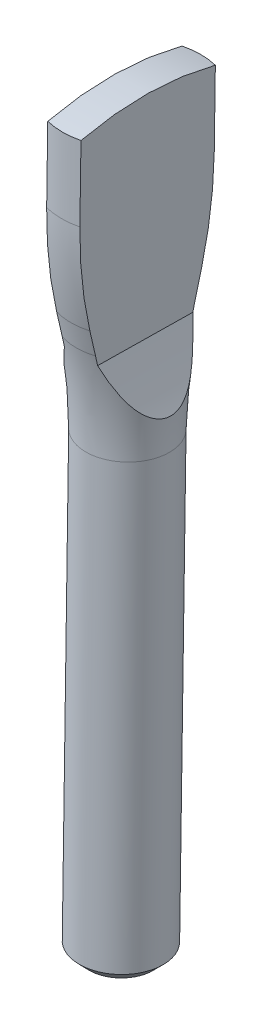
ISO-10303-21;
HEADER;
FILE_DESCRIPTION(('STEP AP214'),'2;1');
FILE_NAME('part.step','',(''),(''),'','','');
FILE_SCHEMA(('AUTOMOTIVE_DESIGN { 1 0 10303 214 1 1 1 1 }'));
ENDSEC;
DATA;
#1=APPLICATION_CONTEXT('core data for automotive mechanical design processes');
#2=APPLICATION_PROTOCOL_DEFINITION('international standard','automotive_design',2000,#1);
#3=PRODUCT_CONTEXT('',#1,'mechanical');
#4=PRODUCT('Part','Part','',(#3));
#5=PRODUCT_RELATED_PRODUCT_CATEGORY('part','',(#4));
#6=PRODUCT_DEFINITION_FORMATION('','',#4);
#7=PRODUCT_DEFINITION_CONTEXT('part definition',#1,'design');
#8=PRODUCT_DEFINITION('design','',#6,#7);
#9=PRODUCT_DEFINITION_SHAPE('','',#8);
#10=(LENGTH_UNIT() NAMED_UNIT(*) SI_UNIT(.MILLI.,.METRE.));
#11=(NAMED_UNIT(*) PLANE_ANGLE_UNIT() SI_UNIT($,.RADIAN.));
#12=(NAMED_UNIT(*) SI_UNIT($,.STERADIAN.) SOLID_ANGLE_UNIT());
#13=UNCERTAINTY_MEASURE_WITH_UNIT(LENGTH_MEASURE(1.E-05),#10,'distance_accuracy_value','');
#14=(GEOMETRIC_REPRESENTATION_CONTEXT(3) GLOBAL_UNCERTAINTY_ASSIGNED_CONTEXT((#13)) GLOBAL_UNIT_ASSIGNED_CONTEXT((#10,
#11,#12)) REPRESENTATION_CONTEXT('',''));
#15=CARTESIAN_POINT('',(0.,0.,0.));
#16=DIRECTION('',(0.,0.,1.));
#17=DIRECTION('',(1.,0.,0.));
#18=AXIS2_PLACEMENT_3D('',#15,#16,#17);
#19=CARTESIAN_POINT('',(1.20000000000001,11.4730721932824,6.26532680167068));
#20=DIRECTION('',(1.,0.,0.));
#21=DIRECTION('',(0.,0.0145894129434997,0.999893568851187));
#22=AXIS2_PLACEMENT_3D('',#19,#20,#21);
#23=PLANE('',#22);
#24=CARTESIAN_POINT('',(1.20000000000001,4.690294529566,7.3203937052377));
#25=CARTESIAN_POINT('',(1.20000000000006,5.77738395157146,7.03749489731836));
#26=CARTESIAN_POINT('',(1.20000000000004,6.88190902063251,6.81944434918929));
#27=CARTESIAN_POINT('',(1.19999999999998,9.10120382897109,6.51425460831759));
#28=CARTESIAN_POINT('',(1.19999999999996,10.2158512075763,6.42622710273024));
#29=CARTESIAN_POINT('',(1.20000000000001,11.3974044974069,6.40089820380064));
#30=CARTESIAN_POINT('',(1.20000000000002,11.4638089190546,6.39970209225563));
#31=CARTESIAN_POINT('',(1.20000000000002,11.53021336893,6.39873335612487));
#32=B_SPLINE_CURVE_WITH_KNOTS('',3,(#24,#25,#26,#27,#28,#29,#30,#31),.UNSPECIFIED.,.F.,.F.,(4,2,
2,4),(0.,3.36918139738961,6.71523645334502,6.91448027689949),.UNSPECIFIED.);
#33=CARTESIAN_POINT('',(1.20000000000001,4.69029452958294,7.32039370523267));
#34=VERTEX_POINT('',#33);
#35=CARTESIAN_POINT('',(1.20000000000001,11.5302133415265,6.39873335652471));
#36=VERTEX_POINT('',#35);
#37=EDGE_CURVE('E195',#34,#36,#32,.T.);
#38=ORIENTED_EDGE('',*,*,#37,.T.);
#39=DIRECTION('',(0.,0.999893568851187,-0.014589412943501));
#40=VECTOR('',#39,1.);
#41=CARTESIAN_POINT('',(1.20000000000001,14.2141414325312,6.35957225333318));
#42=LINE('',#41,#40);
#43=CARTESIAN_POINT('',(1.20000000000001,16.8980695509396,6.32041114974181));
#44=VERTEX_POINT('',#43);
#45=EDGE_CURVE('E168',#44,#36,#42,.F.);
#46=ORIENTED_EDGE('',*,*,#45,.F.);
#47=CARTESIAN_POINT('',(1.20000000000001,-2.39397111707907,11.4562817539835));
#48=DIRECTION('',(-1.,0.,0.));
#49=DIRECTION('',(0.,-1.,0.));
#50=AXIS2_PLACEMENT_3D('',#47,#48,#49);
#51=CIRCLE('',#50,19.9639675415484);
#52=CARTESIAN_POINT('',(1.20000000000001,17.0396996163078,16.027106824614));
#53=VERTEX_POINT('',#52);
#54=EDGE_CURVE('E282',#53,#44,#51,.T.);
#55=ORIENTED_EDGE('',*,*,#54,.F.);
#56=DIRECTION('',(0.,0.999893568851187,-0.014589412943501));
#57=VECTOR('',#56,1.);
#58=CARTESIAN_POINT('',(1.20000000000001,14.3557714978994,16.0662679282054));
#59=LINE('',#58,#57);
#60=CARTESIAN_POINT('',(1.20000000000001,11.6718433612221,16.1054290320634));
#61=VERTEX_POINT('',#60);
#62=EDGE_CURVE('E167',#61,#53,#59,.T.);
#63=ORIENTED_EDGE('',*,*,#62,.F.);
#64=CARTESIAN_POINT('',(1.1999999999442,11.6718433429525,16.1054290322862));
#65=CARTESIAN_POINT('',(1.19999999978519,11.6054389284788,16.1063981054303));
#66=CARTESIAN_POINT('',(1.19999999963981,11.5390279083861,16.1071398993501));
#67=CARTESIAN_POINT('',(1.1999999972814,10.3572386495226,16.1162944492696));
#68=CARTESIAN_POINT('',(1.19999999867737,9.24049751239122,16.0608250584461));
#69=CARTESIAN_POINT('',(1.20000000133179,7.01324333158066,15.8205147641818));
#70=CARTESIAN_POINT('',(1.20000000258923,5.90282667931343,15.634782356129));
#71=CARTESIAN_POINT('',(1.20000000000001,4.80794625704109,15.3837205937621));
#72=B_SPLINE_CURVE_WITH_KNOTS('',3,(#64,#65,#66,#67,#68,#69,#70,#71),.UNSPECIFIED.,.F.,.F.,(4,2,
2,4),(0.,0.199243732104466,3.54529878859164,6.91448018553023),.UNSPECIFIED.);
#73=CARTESIAN_POINT('',(1.20000000000001,4.80794625704116,15.3837205937618));
#74=VERTEX_POINT('',#73);
#75=EDGE_CURVE('E59',#61,#74,#72,.T.);
#76=ORIENTED_EDGE('',*,*,#75,.T.);
#77=CARTESIAN_POINT('',(1.20000000000001,4.80794625704123,15.3837205937615));
#78=CARTESIAN_POINT('',(1.20000000000001,4.51293653895963,15.316069808468));
#79=CARTESIAN_POINT('',(1.20000000000001,4.21796728878133,15.2482435109421));
#80=CARTESIAN_POINT('',(1.20000000000001,3.62810971342622,15.112239888934));
#81=CARTESIAN_POINT('',(1.20000000000001,3.33322138825238,15.044062564439));
#82=CARTESIAN_POINT('',(1.20000000000001,3.0383735309848,14.9757097276987));
#83=B_SPLINE_CURVE_WITH_KNOTS('',3,(#77,#78,#79,#80,#81,#82),.UNSPECIFIED.,.F.,.F.,(4,2,4),(0.,
0.908000763590777,1.81600156044734),.UNSPECIFIED.);
#84=CARTESIAN_POINT('',(1.20000000000001,3.03837353097341,14.9757097276949));
#85=VERTEX_POINT('',#84);
#86=EDGE_CURVE('E240',#74,#85,#83,.T.);
#87=ORIENTED_EDGE('',*,*,#86,.T.);
#88=CARTESIAN_POINT('',(1.20000000000001,3.03837353098572,14.9757097276948));
#89=CARTESIAN_POINT('',(1.20000000000001,2.92449158242886,14.9492985581661));
#90=CARTESIAN_POINT('',(1.20000000000001,2.81046268747634,14.9235565478094));
#91=CARTESIAN_POINT('',(1.20000000000001,2.58211101292977,14.8734108472299));
#92=CARTESIAN_POINT('',(1.20000000000001,2.46778823335669,14.8490071569115));
#93=CARTESIAN_POINT('',(1.20000000000001,2.35331850740894,14.8252726256697));
#94=B_SPLINE_CURVE_WITH_KNOTS('',3,(#88,#89,#90,#91,#92,#93),.UNSPECIFIED.,.F.,.F.,(4,2,4),(0.,
0.350695252080265,0.701390479128246),.UNSPECIFIED.);
#95=CARTESIAN_POINT('',(1.20000000000001,2.35331850740894,14.8252726256697));
#96=VERTEX_POINT('',#95);
#97=EDGE_CURVE('E234',#85,#96,#94,.T.);
#98=ORIENTED_EDGE('',*,*,#97,.T.);
#99=DIRECTION('',(0.,0.0145894129435013,0.999893568851187));
#100=VECTOR('',#99,1.);
#101=CARTESIAN_POINT('',(1.20000000000002,2.30275735075608,11.3600355001833));
#102=LINE('',#101,#100);
#103=CARTESIAN_POINT('',(1.20000000000001,2.25300484146818,7.9502194737381));
#104=VERTEX_POINT('',#103);
#105=EDGE_CURVE('E145',#104,#96,#102,.T.);
#106=ORIENTED_EDGE('',*,*,#105,.F.);
#107=CARTESIAN_POINT('',(1.20000000000001,2.25300484146818,7.9502194737381));
#108=CARTESIAN_POINT('',(1.20000000000001,2.36673336538534,7.92315530961932));
#109=CARTESIAN_POINT('',(1.20000000000001,2.4802954822851,7.89542655855267));
#110=CARTESIAN_POINT('',(1.20000000000001,2.70708691014389,7.83863988049692));
#111=CARTESIAN_POINT('',(1.20000000000001,2.82031622107916,7.80958195341294));
#112=CARTESIAN_POINT('',(1.20000000000001,2.93337912497327,7.77985943928621));
#113=B_SPLINE_CURVE_WITH_KNOTS('',3,(#107,#108,#109,#110,#111,#112),.UNSPECIFIED.,.F.,.F.,(4,2,
4),(0.,0.350695227047989,0.701390479128262),.UNSPECIFIED.);
#114=CARTESIAN_POINT('',(1.20000000000001,2.93337912496045,7.77985943928444));
#115=VERTEX_POINT('',#114);
#116=EDGE_CURVE('E228',#104,#115,#113,.T.);
#117=ORIENTED_EDGE('',*,*,#116,.T.);
#118=CARTESIAN_POINT('',(1.20000000000001,2.93337912497223,7.77985943928226));
#119=CARTESIAN_POINT('',(1.20000000000001,3.22610722168643,7.70293330184706));
#120=CARTESIAN_POINT('',(1.20000000000001,3.5188808897758,7.62618142126093));
#121=CARTESIAN_POINT('',(1.20000000000001,4.10451935797711,7.47302617659237));
#122=CARTESIAN_POINT('',(1.20000000000001,4.3973841580857,7.39662281249715));
#123=CARTESIAN_POINT('',(1.20000000000001,4.69029452956614,7.32039370523825));
#124=B_SPLINE_CURVE_WITH_KNOTS('',3,(#118,#119,#120,#121,#122,#123),.UNSPECIFIED.,.F.,.F.,(4,2,
4),(0.,0.908000796860956,1.81600156045612),.UNSPECIFIED.);
#125=EDGE_CURVE('E210',#115,#34,#124,.T.);
#126=ORIENTED_EDGE('',*,*,#125,.T.);
#127=EDGE_LOOP('',(#38,#46,#55,#63,#76,#87,#98,#106,#117,#126));
#128=FACE_BOUND('',#127,.T.);
#129=ADVANCED_FACE('F34',(#128),#23,.T.);
#130=CARTESIAN_POINT('',(0.,-2.39397111707907,11.4562817539835));
#131=DIRECTION('',(-1.,0.,0.));
#132=DIRECTION('',(0.,-1.,0.));
#133=AXIS2_PLACEMENT_3D('',#130,#131,#132);
#134=SPHERICAL_SURFACE('',#133,20.);
#135=CARTESIAN_POINT('',(-1.20000000000003,-2.39397111707907,11.4562817539835));
#136=DIRECTION('',(-1.,0.,0.));
#137=DIRECTION('',(0.,-1.,0.));
#138=AXIS2_PLACEMENT_3D('',#135,#136,#137);
#139=CIRCLE('',#138,19.9639675415484);
#140=CARTESIAN_POINT('',(-1.20000000000003,17.0396996163078,16.027106824614));
#141=VERTEX_POINT('',#140);
#142=CARTESIAN_POINT('',(-1.20000000000001,16.8980695509396,6.3204111497418));
#143=VERTEX_POINT('',#142);
#144=EDGE_CURVE('E279',#141,#143,#139,.T.);
#145=ORIENTED_EDGE('',*,*,#144,.F.);
#146=CARTESIAN_POINT('',(0.,16.9688845836237,11.1737589871779));
#147=DIRECTION('',(0.,0.999893568851187,-0.014589412943501));
#148=DIRECTION('',(0.,0.014589412943501,0.999893568851187));
#149=AXIS2_PLACEMENT_3D('',#146,#147,#148);
#150=CIRCLE('',#149,5.);
#151=EDGE_CURVE('E307',#53,#141,#150,.F.);
#152=ORIENTED_EDGE('',*,*,#151,.F.);
#153=ORIENTED_EDGE('',*,*,#54,.T.);
#154=CARTESIAN_POINT('',(0.,16.9688845836237,11.1737589871779));
#155=DIRECTION('',(0.,0.999893568851187,-0.014589412943501));
#156=DIRECTION('',(0.,0.014589412943501,0.999893568851187));
#157=AXIS2_PLACEMENT_3D('',#154,#155,#156);
#158=CIRCLE('',#157,5.);
#159=EDGE_CURVE('E294',#143,#44,#158,.F.);
#160=ORIENTED_EDGE('',*,*,#159,.F.);
#161=EDGE_LOOP('',(#145,#152,#153,#160));
#162=FACE_BOUND('',#161,.T.);
#163=ADVANCED_FACE('F175',(#162),#134,.T.);
#164=CARTESIAN_POINT('',(-1.20000000000003,17.5678716364691,11.1650191875292));
#165=DIRECTION('',(-1.,0.,0.));
#166=DIRECTION('',(0.,-1.,0.));
#167=AXIS2_PLACEMENT_3D('',#164,#165,#166);
#168=PLANE('',#167);
#169=ORIENTED_EDGE('',*,*,#144,.T.);
#170=DIRECTION('',(0.,0.999893568851187,-0.014589412943501));
#171=VECTOR('',#170,1.);
#172=CARTESIAN_POINT('',(-1.19999999999999,14.2141414325312,6.35957225333316));
#173=LINE('',#172,#171);
#174=CARTESIAN_POINT('',(-1.20000000000003,11.5302133141229,6.39873335692455));
#175=VERTEX_POINT('',#174);
#176=EDGE_CURVE('E293',#175,#143,#173,.T.);
#177=ORIENTED_EDGE('',*,*,#176,.F.);
#178=CARTESIAN_POINT('',(-1.19999999999999,11.5302133141414,6.39873335692427));
#179=CARTESIAN_POINT('',(-1.19999999999999,11.4638088855835,6.39970209286906));
#180=CARTESIAN_POINT('',(-1.19999999999999,11.3974044852537,6.40089820408212));
#181=CARTESIAN_POINT('',(-1.19999999999999,10.2158512152048,6.42622710221491));
#182=CARTESIAN_POINT('',(-1.19999999999999,9.101203835019,6.51425460766293));
#183=CARTESIAN_POINT('',(-1.19999999999999,6.88190902358653,6.81944434860472));
#184=CARTESIAN_POINT('',(-1.2,5.77738395301156,7.03749489693988));
#185=CARTESIAN_POINT('',(-1.20000000000003,4.69029452956599,7.32039370523769));
#186=B_SPLINE_CURVE_WITH_KNOTS('',3,(#178,#179,#180,#181,#182,#183,#184,#185),.UNSPECIFIED.,.F.,
.F.,(4,2,2,4),(0.,0.199243759595049,3.5452988201844,6.91448022209),.UNSPECIFIED.);
#187=CARTESIAN_POINT('',(-1.20000000000003,4.69029452958301,7.32039370523295));
#188=VERTEX_POINT('',#187);
#189=EDGE_CURVE('E39',#175,#188,#186,.T.);
#190=ORIENTED_EDGE('',*,*,#189,.T.);
#191=CARTESIAN_POINT('',(-1.20000000000003,4.69029452956614,7.32039370523825));
#192=CARTESIAN_POINT('',(-1.20000000000003,4.3973841580857,7.39662281249715));
#193=CARTESIAN_POINT('',(-1.20000000000003,4.10451935797711,7.47302617659236));
#194=CARTESIAN_POINT('',(-1.20000000000003,3.5188808897758,7.62618142126093));
#195=CARTESIAN_POINT('',(-1.20000000000003,3.22610722168643,7.70293330184705));
#196=CARTESIAN_POINT('',(-1.20000000000003,2.93337912497224,7.77985943928226));
#197=B_SPLINE_CURVE_WITH_KNOTS('',3,(#191,#192,#193,#194,#195,#196),.UNSPECIFIED.,.F.,.F.,(4,2,
4),(0.,0.908000763595165,1.81600156045612),.UNSPECIFIED.);
#198=CARTESIAN_POINT('',(-1.20000000000003,2.93337912496097,7.77985943928641));
#199=VERTEX_POINT('',#198);
#200=EDGE_CURVE('E203',#188,#199,#197,.T.);
#201=ORIENTED_EDGE('',*,*,#200,.T.);
#202=CARTESIAN_POINT('',(-1.20000000000003,2.93337912497327,7.77985943928621));
#203=CARTESIAN_POINT('',(-1.20000000000003,2.82031622107919,7.80958195341293));
#204=CARTESIAN_POINT('',(-1.20000000000003,2.70708691014394,7.8386398804969));
#205=CARTESIAN_POINT('',(-1.20000000000003,2.4802954822852,7.89542655855264));
#206=CARTESIAN_POINT('',(-1.20000000000003,2.36673336538547,7.92315530961929));
#207=CARTESIAN_POINT('',(-1.20000000000003,2.25300484146833,7.95021947373805));
#208=B_SPLINE_CURVE_WITH_KNOTS('',3,(#202,#203,#204,#205,#206,#207),.UNSPECIFIED.,.F.,.F.,(4,2,
4),(0.,0.350695252080196,0.701390479128108),.UNSPECIFIED.);
#209=CARTESIAN_POINT('',(-1.20000000000003,2.25300484146825,7.95021947373808));
#210=VERTEX_POINT('',#209);
#211=EDGE_CURVE('E97',#199,#210,#208,.T.);
#212=ORIENTED_EDGE('',*,*,#211,.T.);
#213=DIRECTION('',(0.,-0.014589412943501,-0.999893568851187));
#214=VECTOR('',#213,1.);
#215=CARTESIAN_POINT('',(-1.20000000000002,2.30316167443855,11.3877460497039));
#216=LINE('',#215,#214);
#217=CARTESIAN_POINT('',(-1.20000000000003,2.35331850740893,14.8252726256697));
#218=VERTEX_POINT('',#217);
#219=EDGE_CURVE('E134',#218,#210,#216,.T.);
#220=ORIENTED_EDGE('',*,*,#219,.F.);
#221=CARTESIAN_POINT('',(-1.20000000000003,2.35331850740894,14.8252726256697));
#222=CARTESIAN_POINT('',(-1.20000000000003,2.46778823335669,14.8490071569115));
#223=CARTESIAN_POINT('',(-1.20000000000003,2.58211101292977,14.8734108472299));
#224=CARTESIAN_POINT('',(-1.20000000000003,2.81046268747634,14.9235565478094));
#225=CARTESIAN_POINT('',(-1.20000000000003,2.92449158242885,14.9492985581661));
#226=CARTESIAN_POINT('',(-1.20000000000003,3.03837353098572,14.9757097276948));
#227=B_SPLINE_CURVE_WITH_KNOTS('',3,(#221,#222,#223,#224,#225,#226),.UNSPECIFIED.,.F.,.F.,(4,2,
4),(0.,0.350695227047983,0.701390479128249),.UNSPECIFIED.);
#228=CARTESIAN_POINT('',(-1.20000000000003,3.03837353097296,14.9757097276969));
#229=VERTEX_POINT('',#228);
#230=EDGE_CURVE('E140',#218,#229,#227,.T.);
#231=ORIENTED_EDGE('',*,*,#230,.T.);
#232=CARTESIAN_POINT('',(-1.20000000000003,3.0383735309848,14.9757097276987));
#233=CARTESIAN_POINT('',(-1.20000000000003,3.33322138825238,15.044062564439));
#234=CARTESIAN_POINT('',(-1.20000000000003,3.62810971342622,15.112239888934));
#235=CARTESIAN_POINT('',(-1.20000000000003,4.21796728878133,15.2482435109421));
#236=CARTESIAN_POINT('',(-1.20000000000003,4.51293653895963,15.316069808468));
#237=CARTESIAN_POINT('',(-1.20000000000003,4.80794625704123,15.3837205937615));
#238=B_SPLINE_CURVE_WITH_KNOTS('',3,(#232,#233,#234,#235,#236,#237),.UNSPECIFIED.,.F.,.F.,(4,2,
4),(0.,0.908000796856568,1.81600156044734),.UNSPECIFIED.);
#239=CARTESIAN_POINT('',(-1.20000000000003,4.80794625704109,15.3837205937621));
#240=VERTEX_POINT('',#239);
#241=EDGE_CURVE('E142',#229,#240,#238,.T.);
#242=ORIENTED_EDGE('',*,*,#241,.T.);
#243=CARTESIAN_POINT('',(-1.20000000000003,4.80794625704109,15.3837205937621));
#244=CARTESIAN_POINT('',(-1.20000000285758,5.90282667932746,15.6347823563399));
#245=CARTESIAN_POINT('',(-1.20000000146518,7.01324333159007,15.8205147642869));
#246=CARTESIAN_POINT('',(-1.19999999854486,9.24049751237765,16.0608250583412));
#247=CARTESIAN_POINT('',(-1.19999999701795,10.3572386494905,16.1162944490619));
#248=CARTESIAN_POINT('',(-1.19999999965946,11.5390279205457,16.1071398992714));
#249=CARTESIAN_POINT('',(-1.19999999982217,11.6054389528286,16.1063981051874));
#250=CARTESIAN_POINT('',(-1.19999999999999,11.6718433794898,16.1054290317968));
#251=B_SPLINE_CURVE_WITH_KNOTS('',3,(#243,#244,#245,#246,#247,#248,#249,#250),.UNSPECIFIED.,.F.,
.F.,(4,2,2,4),(0.,3.36918139694341,6.71523645339375,6.91448022207099),.UNSPECIFIED.);
#252=CARTESIAN_POINT('',(-1.20000000000003,11.671843379491,16.1054290317968));
#253=VERTEX_POINT('',#252);
#254=EDGE_CURVE('E90',#240,#253,#251,.T.);
#255=ORIENTED_EDGE('',*,*,#254,.T.);
#256=DIRECTION('',(0.,0.999893568851187,-0.014589412943501));
#257=VECTOR('',#256,1.);
#258=CARTESIAN_POINT('',(-1.19999999999998,14.3557714978994,16.0662679282054));
#259=LINE('',#258,#257);
#260=EDGE_CURVE('E165',#141,#253,#259,.F.);
#261=ORIENTED_EDGE('',*,*,#260,.F.);
#262=EDGE_LOOP('',(#169,#177,#190,#201,#212,#220,#231,#242,#255,#261));
#263=FACE_BOUND('',#262,.T.);
#264=ADVANCED_FACE('F144',(#263),#168,.T.);
#265=CARTESIAN_POINT('',(0.,14.2849564652153,11.2129200907693));
#266=DIRECTION('',(0.,0.999893568851187,-0.014589412943501));
#267=DIRECTION('',(0.,0.014589412943501,0.999893568851187));
#268=AXIS2_PLACEMENT_3D('',#265,#266,#267);
#269=CYLINDRICAL_SURFACE('',#268,5.);
#270=ORIENTED_EDGE('',*,*,#176,.T.);
#271=ORIENTED_EDGE('',*,*,#159,.T.);
#272=ORIENTED_EDGE('',*,*,#45,.T.);
#273=CARTESIAN_POINT('',(0.,11.6010283468067,11.2520811943607));
#274=DIRECTION('',(0.,-0.999893568851188,0.014589412943432));
#275=DIRECTION('',(0.,-0.014589412943432,-0.999893568851188));
#276=AXIS2_PLACEMENT_3D('',#273,#274,#275);
#277=CIRCLE('',#276,5.00000000000004);
#278=EDGE_CURVE('E160',#175,#36,#277,.T.);
#279=ORIENTED_EDGE('',*,*,#278,.F.);
#280=EDGE_LOOP('',(#270,#271,#272,#279));
#281=FACE_BOUND('',#280,.T.);
#282=ADVANCED_FACE('F297',(#281),#269,.T.);
#283=CARTESIAN_POINT('',(0.,14.2849564652153,11.2129200907693));
#284=DIRECTION('',(0.,0.999893568851187,-0.014589412943501));
#285=DIRECTION('',(0.,0.014589412943501,0.999893568851187));
#286=AXIS2_PLACEMENT_3D('',#283,#284,#285);
#287=CYLINDRICAL_SURFACE('',#286,5.);
#288=ORIENTED_EDGE('',*,*,#260,.T.);
#289=CARTESIAN_POINT('',(0.,11.6010283468077,11.2520811943603));
#290=DIRECTION('',(0.,-0.99989356885119,0.0145894129433412));
#291=DIRECTION('',(0.,-0.0145894129433412,-0.99989356885119));
#292=AXIS2_PLACEMENT_3D('',#289,#290,#291);
#293=CIRCLE('',#292,5.00000000000037);
#294=EDGE_CURVE('E150',#61,#253,#293,.T.);
#295=ORIENTED_EDGE('',*,*,#294,.F.);
#296=ORIENTED_EDGE('',*,*,#62,.T.);
#297=ORIENTED_EDGE('',*,*,#151,.T.);
#298=EDGE_LOOP('',(#288,#295,#296,#297));
#299=FACE_BOUND('',#298,.T.);
#300=ADVANCED_FACE('F188',(#299),#287,.T.);
#301=CARTESIAN_POINT('',(0.,11.6010283468068,11.2520811943607));
#302=DIRECTION('',(0.,-0.999893568851187,0.0145894129435082));
#303=DIRECTION('',(0.,-0.0145894129435082,-0.999893568851187));
#304=AXIS2_PLACEMENT_3D('',#301,#302,#303);
#305=DEGENERATE_TOROIDAL_SURFACE('',#304,24.9999999999999,29.9999999999999,.F.);
#306=ORIENTED_EDGE('',*,*,#189,.F.);
#307=ORIENTED_EDGE('',*,*,#278,.T.);
#308=ORIENTED_EDGE('',*,*,#37,.F.);
#309=CARTESIAN_POINT('',(0.,4.74912039334185,11.3520571495004));
#310=DIRECTION('',(0.,0.999893568851187,-0.014589412943501));
#311=DIRECTION('',(-1.,0.,0.));
#312=AXIS2_PLACEMENT_3D('',#309,#310,#311);
#313=CIRCLE('',#312,4.20687183191147);
#314=EDGE_CURVE('E157',#188,#34,#313,.F.);
#315=ORIENTED_EDGE('',*,*,#314,.F.);
#316=EDGE_LOOP('',(#306,#307,#308,#315));
#317=FACE_BOUND('',#316,.T.);
#318=ADVANCED_FACE('F183',(#317),#305,.F.);
#319=CARTESIAN_POINT('',(0.,4.74912039322816,11.352057149502));
#320=DIRECTION('',(0.,0.999893568851187,-0.014589412943501));
#321=DIRECTION('',(0.,0.014589412943501,0.999893568851187));
#322=AXIS2_PLACEMENT_3D('',#319,#320,#321);
#323=CONICAL_SURFACE('',#322,4.20687183188305,0.230455744467248);
#324=ORIENTED_EDGE('',*,*,#200,.F.);
#325=ORIENTED_EDGE('',*,*,#314,.T.);
#326=ORIENTED_EDGE('',*,*,#125,.F.);
#327=CARTESIAN_POINT('',(0.,2.98587632795488,11.3777845834908));
#328=DIRECTION('',(0.,0.999893568851187,-0.014589412943501));
#329=DIRECTION('',(-1.,0.,0.));
#330=AXIS2_PLACEMENT_3D('',#327,#328,#329);
#331=CIRCLE('',#330,3.79312816809828);
#332=EDGE_CURVE('E159',#115,#199,#331,.T.);
#333=ORIENTED_EDGE('',*,*,#332,.T.);
#334=EDGE_LOOP('',(#324,#325,#326,#333));
#335=FACE_BOUND('',#334,.T.);
#336=ADVANCED_FACE('F187',(#335),#323,.T.);
#337=CARTESIAN_POINT('',(0.,4.74912039322816,11.352057149502));
#338=DIRECTION('',(0.,0.999893568851187,-0.014589412943501));
#339=DIRECTION('',(0.,0.014589412943501,0.999893568851187));
#340=AXIS2_PLACEMENT_3D('',#337,#338,#339);
#341=CONICAL_SURFACE('',#340,4.20687183188305,0.230455744467248);
#342=ORIENTED_EDGE('',*,*,#241,.F.);
#343=CARTESIAN_POINT('',(0.,2.98587632795488,11.3777845834908));
#344=DIRECTION('',(0.,0.999893568851187,-0.014589412943501));
#345=DIRECTION('',(-1.,0.,0.));
#346=AXIS2_PLACEMENT_3D('',#343,#344,#345);
#347=CIRCLE('',#346,3.79312816809828);
#348=EDGE_CURVE('E124',#229,#85,#347,.T.);
#349=ORIENTED_EDGE('',*,*,#348,.T.);
#350=ORIENTED_EDGE('',*,*,#86,.F.);
#351=CARTESIAN_POINT('',(0.,4.74912039329924,11.3520571495005));
#352=DIRECTION('',(0.,0.999893568851187,-0.0145894129435107));
#353=DIRECTION('',(0.,0.0145894129435107,0.999893568851187));
#354=AXIS2_PLACEMENT_3D('',#351,#352,#353);
#355=CIRCLE('',#354,4.2068718319008);
#356=EDGE_CURVE('E155',#240,#74,#355,.T.);
#357=ORIENTED_EDGE('',*,*,#356,.F.);
#358=EDGE_LOOP('',(#342,#349,#350,#357));
#359=FACE_BOUND('',#358,.T.);
#360=ADVANCED_FACE('F252',(#359),#341,.T.);
#361=CARTESIAN_POINT('',(0.,11.6010283468073,11.2520811943601));
#362=DIRECTION('',(0.,-0.999893568851187,0.0145894129435137));
#363=DIRECTION('',(0.,-0.0145894129435137,-0.999893568851187));
#364=AXIS2_PLACEMENT_3D('',#361,#362,#363);
#365=DEGENERATE_TOROIDAL_SURFACE('',#364,25.,30.0000000000005,.F.);
#366=ORIENTED_EDGE('',*,*,#254,.F.);
#367=ORIENTED_EDGE('',*,*,#356,.T.);
#368=ORIENTED_EDGE('',*,*,#75,.F.);
#369=ORIENTED_EDGE('',*,*,#294,.T.);
#370=EDGE_LOOP('',(#366,#367,#368,#369));
#371=FACE_BOUND('',#370,.T.);
#372=ADVANCED_FACE('F190',(#371),#365,.F.);
#373=CARTESIAN_POINT('',(25.,11.6512040887937,14.6909037103314));
#374=DIRECTION('',(0.,-0.0145894129435007,-0.999893568851187));
#375=DIRECTION('',(0.,0.999893568851187,-0.0145894129435007));
#376=AXIS2_PLACEMENT_3D('',#373,#374,#375);
#377=CYLINDRICAL_SURFACE('',#376,25.5520787727753);
#378=ORIENTED_EDGE('',*,*,#105,.T.);
#379=CARTESIAN_POINT('',(1.20000000000008,2.25300484146821,7.95021947373812));
#380=CARTESIAN_POINT('',(1.24344667286887,2.14239413290872,7.99176649977505));
#381=CARTESIAN_POINT('',(1.28759495991483,2.03230751648585,8.03399748676813));
#382=CARTESIAN_POINT('',(1.37719719927022,1.81334975030564,8.12027851311386));
#383=CARTESIAN_POINT('',(1.42265148241384,1.70447891840418,8.16432901464387));
#384=CARTESIAN_POINT('',(1.51503621330909,1.48749472257005,8.25496429670349));
#385=CARTESIAN_POINT('',(1.56197416242519,1.37939046499406,8.3015633071143));
#386=CARTESIAN_POINT('',(1.65689695945287,1.16490030852743,8.39754957167732));
#387=CARTESIAN_POINT('',(1.70488171964918,1.05851426695277,8.44693659276062));
#388=CARTESIAN_POINT('',(1.80271018609193,0.84558419183865,8.55013078250953));
#389=CARTESIAN_POINT('',(1.85257181842715,0.739082239252305,8.60400815516693));
#390=CARTESIAN_POINT('',(1.95291778628003,0.528607654213208,8.71595441688743));
#391=CARTESIAN_POINT('',(2.00340205538514,0.424634755459733,8.77402286206811));
#392=CARTESIAN_POINT('',(2.1045134615756,0.220006687196552,8.89498869295408));
#393=CARTESIAN_POINT('',(2.15513992582064,0.119343872177386,8.95787364151949));
#394=CARTESIAN_POINT('',(2.25616767499398,-0.0781945964157955,9.08946432847998));
#395=CARTESIAN_POINT('',(2.30656904186105,-0.175071748091328,9.15816772953821));
#396=CARTESIAN_POINT('',(2.38813885455558,-0.329372152858587,9.27590876404499));
#397=CARTESIAN_POINT('',(2.41957214451077,-0.388217560269133,9.3229012615435));
#398=CARTESIAN_POINT('',(2.48187386243666,-0.503707949854789,9.41990619249293));
#399=CARTESIAN_POINT('',(2.51274219662068,-0.560352568404716,9.46991912153676));
#400=CARTESIAN_POINT('',(2.57361105079723,-0.670990535234146,9.5731929077028));
#401=CARTESIAN_POINT('',(2.60361234921172,-0.724986294086069,9.62645070902223));
#402=CARTESIAN_POINT('',(2.66244257121457,-0.829901748423947,9.73653242143764));
#403=CARTESIAN_POINT('',(2.69127154052025,-0.880821563900116,9.79335619325128));
#404=CARTESIAN_POINT('',(2.74774296186677,-0.979689505460276,9.91166793369256));
#405=CARTESIAN_POINT('',(2.77536339741754,-1.02758658868912,9.97320968408216));
#406=CARTESIAN_POINT('',(2.82845544775944,-1.11886857121148,10.1004212228706));
#407=CARTESIAN_POINT('',(2.85392630164218,-1.16225187397285,10.1660924587882));
#408=CARTESIAN_POINT('',(2.92606439845934,-1.28409078843796,10.3692695877158));
#409=CARTESIAN_POINT('',(2.96868712447686,-1.35463508552961,10.5133980393008));
#410=CARTESIAN_POINT('',(3.02506547222065,-1.4463821543642,10.7640403186101));
#411=CARTESIAN_POINT('',(3.04370664950421,-1.47621167213907,10.86633040383));
#412=CARTESIAN_POINT('',(3.07203258087652,-1.52063635874069,11.0752735357345));
#413=CARTESIAN_POINT('',(3.08174346791289,-1.53527599435971,11.1819128923727));
#414=CARTESIAN_POINT('',(3.0876434830028,-1.54317429315824,11.3148492145981));
#415=CARTESIAN_POINT('',(3.08850049162313,-1.54422688886028,11.3406347833815));
#416=CARTESIAN_POINT('',(3.08964496586764,-1.54538163870265,11.3922464501729));
#417=CARTESIAN_POINT('',(3.0899323449018,-1.54548364835207,11.4180725537456));
#418=CARTESIAN_POINT('',(3.08993161925625,-1.54420861849679,11.5053849632794));
#419=CARTESIAN_POINT('',(3.08830051650109,-1.54059423569586,11.5668588601635));
#420=CARTESIAN_POINT('',(3.081832962188,-1.52802199738755,11.6891199306519));
#421=CARTESIAN_POINT('',(3.07699387232715,-1.51905974430763,11.7499064970991));
#422=CARTESIAN_POINT('',(3.06426098234366,-1.49601020425187,11.8703426195395));
#423=CARTESIAN_POINT('',(3.05635901604345,-1.48190922256793,11.9299886848383));
#424=CARTESIAN_POINT('',(3.0377576881656,-1.44896124235651,12.0475205271343));
#425=CARTESIAN_POINT('',(3.02705672741501,-1.4301115309251,12.1054052766504));
#426=CARTESIAN_POINT('',(2.99150330432707,-1.36761405709929,12.2744551709077));
#427=CARTESIAN_POINT('',(2.96302061312441,-1.31769809179224,12.3825874306942));
#428=CARTESIAN_POINT('',(2.89888525057304,-1.20477048318604,12.5890564253907));
#429=CARTESIAN_POINT('',(2.86323894438411,-1.1417704639446,12.6874017412152));
#430=CARTESIAN_POINT('',(2.79222148656045,-1.01517356528368,12.8616682437974));
#431=CARTESIAN_POINT('',(2.75749534981937,-0.952866606156322,12.9388090151326));
#432=CARTESIAN_POINT('',(2.68538736629523,-0.822312995335917,13.0866018306977));
#433=CARTESIAN_POINT('',(2.6480035923718,-0.754062025204615,13.1572490793654));
#434=CARTESIAN_POINT('',(2.57110922846304,-0.612225135326425,13.293214877636));
#435=CARTESIAN_POINT('',(2.53158231939984,-0.538596147290751,13.3584788073055));
#436=CARTESIAN_POINT('',(2.45140192983751,-0.387534592294818,13.4835784994191));
#437=CARTESIAN_POINT('',(2.41074890495488,-0.310103554089993,13.5434164164846));
#438=CARTESIAN_POINT('',(2.31869707644945,-0.132631494422722,13.6725053379903));
#439=CARTESIAN_POINT('',(2.26712165113655,-0.0317254178560884,13.7404363677617));
#440=CARTESIAN_POINT('',(2.16369623542619,0.173930827664895,13.8700223630286));
#441=CARTESIAN_POINT('',(2.11184614273092,0.278682529794179,13.931674787575));
#442=CARTESIAN_POINT('',(2.00827407839788,0.491531831548073,14.0498117254496));
#443=CARTESIAN_POINT('',(1.9565528077495,0.599637543817051,14.1062821470066));
#444=CARTESIAN_POINT('',(1.85375834621134,0.81837968375422,14.2147396863673));
#445=CARTESIAN_POINT('',(1.80268522736968,0.929016389000557,14.2667263094141));
#446=CARTESIAN_POINT('',(1.70376977388577,1.14732989751567,14.364697032164));
#447=CARTESIAN_POINT('',(1.65588580759893,1.25491417207849,14.4108462870619));
#448=CARTESIAN_POINT('',(1.56116178437867,1.47171019974709,14.5003223327695));
#449=CARTESIAN_POINT('',(1.51432180788652,1.58092207718814,14.5436489065777));
#450=CARTESIAN_POINT('',(1.42214155567503,1.8000098660077,14.6277174873838));
#451=CARTESIAN_POINT('',(1.37679346384628,1.90987673630241,14.6684745704436));
#452=CARTESIAN_POINT('',(1.28739765169282,2.1307681882448,14.7481436459675));
#453=CARTESIAN_POINT('',(1.24334961239417,2.24179247671441,14.7870560924663));
#454=CARTESIAN_POINT('',(1.20000000000007,2.35331850740897,14.8252726256696));
#455=B_SPLINE_CURVE_WITH_KNOTS('',3,(#379,#380,#381,#382,#383,#384,#385,#386,#387,#388,#389,
#390,#391,#392,#393,#394,#395,#396,#397,#398,#399,#400,#401,#402,#403,#404,#405,#406,#407,#408,
#409,#410,#411,#412,#413,#414,#415,#416,#417,#418,#419,#420,#421,#422,#423,#424,#425,#426,#427,
#428,#429,#430,#431,#432,#433,#434,#435,#436,#437,#438,#439,#440,#441,#442,#443,#444,#445,#446,
#447,#448,#449,#450,#451,#452,#453,#454),.UNSPECIFIED.,.F.,.F.,(4,2,2,2,2,2,2,2,2,2,2,2,2,2,2,2,
2,2,2,2,2,2,2,2,2,2,2,2,2,2,2,2,2,2,2,2,2,4),(0.,0.377678712518308,0.755453956895867,
1.13561153101257,1.51573737207946,1.90371084484134,2.2916432869108,2.67860575686746,
3.06541351042594,3.31015122979437,3.5549292154481,3.79948014566616,4.04402152996976,
4.29195636125181,4.53997859151461,5.03409283870455,5.35737152679274,5.67970115716062,
5.75715208688069,5.83461478909858,6.01906349532289,6.20366408378659,6.38876027403396,
6.57396244871564,6.93959548883802,7.30490507441927,7.61964412341059,7.93461377497371,
8.25246290480609,8.57018526174887,8.96629595527464,9.36256632286119,9.75988419978418,
10.1572458621119,10.5366309269204,10.9160451236648,11.2929730347799,11.6698076828266),.UNSPECIFIED.);
#456=EDGE_CURVE('E137',#104,#96,#455,.T.);
#457=ORIENTED_EDGE('',*,*,#456,.F.);
#458=EDGE_LOOP('',(#378,#457));
#459=FACE_BOUND('',#458,.T.);
#460=ADVANCED_FACE('F220',(#459),#377,.F.);
#461=CARTESIAN_POINT('',(-25.,11.5502696318409,7.77330429948331));
#462=DIRECTION('',(0.,0.0145894129435007,0.999893568851187));
#463=DIRECTION('',(0.,-0.999893568851187,0.0145894129435007));
#464=AXIS2_PLACEMENT_3D('',#461,#462,#463);
#465=CYLINDRICAL_SURFACE('',#464,25.5520787727753);
#466=CARTESIAN_POINT('',(-1.20000000000002,2.35331850740894,14.8252726256697));
#467=CARTESIAN_POINT('',(-1.24344667286881,2.2415427216296,14.7869704333831));
#468=CARTESIAN_POINT('',(-1.28759495991477,2.13027084982626,14.7479692805382));
#469=CARTESIAN_POINT('',(-1.37719719927016,1.90888898329564,14.6681132347476));
#470=CARTESIAN_POINT('',(-1.42265148241378,1.79877929280458,14.6272578705475));
#471=CARTESIAN_POINT('',(-1.51503621330903,1.57924311792028,14.5429918423215));
#472=CARTESIAN_POINT('',(-1.56197416242513,1.46982532084009,14.4995666887877));
#473=CARTESIAN_POINT('',(-1.65689695945281,1.25262600483676,14.4098791905868));
#474=CARTESIAN_POINT('',(-1.70488171964911,1.1448443500903,14.3636170830524));
#475=CARTESIAN_POINT('',(-1.80271018609186,0.928994154900283,14.2666792115962));
#476=CARTESIAN_POINT('',(-1.85257181842709,0.820965629243877,14.2159320458263));
#477=CARTESIAN_POINT('',(-1.95291778627998,0.607314530817664,14.1101741874807));
#478=CARTESIAN_POINT('',(-2.00340205538508,0.501691704811087,14.055163946368));
#479=CARTESIAN_POINT('',(-2.10451346157555,0.293621481859593,13.9402197821665));
#480=CARTESIAN_POINT('',(-2.15513992582058,0.191166805522438,13.8802985139864));
#481=CARTESIAN_POINT('',(-2.25616767499393,-0.0101268236449871,13.7545271725549));
#482=CARTESIAN_POINT('',(-2.306569041861,-0.108967205745544,13.6886794793535));
#483=CARTESIAN_POINT('',(-2.38813885455553,-0.266637104027757,13.5754903928931));
#484=CARTESIAN_POINT('',(-2.41957214451072,-0.326828500799823,13.5302347573425));
#485=CARTESIAN_POINT('',(-2.48187386243661,-0.445099914640631,13.4366406368902));
#486=CARTESIAN_POINT('',(-2.51274219662064,-0.503179582698267,13.3883016459975));
#487=CARTESIAN_POINT('',(-2.57361105079718,-0.616783537835348,13.288299766063));
#488=CARTESIAN_POINT('',(-2.60361234921168,-0.672310145305779,13.2366400018533));
#489=CARTESIAN_POINT('',(-2.66244257121454,-0.780392650188406,13.1296661353927));
#490=CARTESIAN_POINT('',(-2.69127154052022,-0.832948663476072,13.0743521758656));
#491=CARTESIAN_POINT('',(-2.74774296186675,-0.935226347015065,12.9589753443764));
#492=CARTESIAN_POINT('',(-2.77536339741751,-0.984898565261935,12.8988572243353));
#493=CARTESIAN_POINT('',(-2.82845544775941,-1.07985317714836,12.7743630573408));
#494=CARTESIAN_POINT('',(-2.85392630164215,-1.12513401716781,12.7099855169051));
#495=CARTESIAN_POINT('',(-2.92606439845931,-1.252848903666,12.5104496189717));
#496=CARTESIAN_POINT('',(-2.96868712447685,-1.32756822131161,12.3684407038326));
#497=CARTESIAN_POINT('',(-3.02506547222065,-1.42658890229027,12.1205819102512));
#498=CARTESIAN_POINT('',(-3.0437066495042,-1.4593901085026,12.0192056677877));
#499=CARTESIAN_POINT('',(-3.07203258087652,-1.50989194981469,11.8116476056129));
#500=CARTESIAN_POINT('',(-3.08174346791291,-1.52763663336015,11.7054807674705));
#501=CARTESIAN_POINT('',(-3.08764348300281,-1.53941008279929,11.5728314750524));
#502=CARTESIAN_POINT('',(-3.08850049162315,-1.54121454295321,11.5470875934735));
#503=CARTESIAN_POINT('',(-3.08964496586766,-1.54387460877349,11.4955315885271));
#504=CARTESIAN_POINT('',(-3.08993234490182,-1.5447300701728,11.4697194553818));
#505=CARTESIAN_POINT('',(-3.08993161925626,-1.54600298554394,11.3824070149956));
#506=CARTESIAN_POINT('',(-3.0883005165011,-1.54418368661716,11.3208538354469));
#507=CARTESIAN_POINT('',(-3.08183296218801,-1.53518385513747,11.1982780076243));
#508=CARTESIAN_POINT('',(-3.07699387232717,-1.52799890916983,11.1372558379467));
#509=CARTESIAN_POINT('',(-3.06426098234367,-1.50847299197647,11.0161984984624));
#510=CARTESIAN_POINT('',(-3.05635901604346,-1.49611823002899,10.9561664183111));
#511=CARTESIAN_POINT('',(-3.0377576881656,-1.46661335199984,10.8377233284916));
#512=CARTESIAN_POINT('',(-3.02705672741501,-1.44946049419163,10.7793132667162));
#513=CARTESIAN_POINT('',(-2.99150330432708,-1.39192177810191,10.6085119285079));
#514=CARTESIAN_POINT('',(-2.96302061312441,-1.34518189869057,10.4989693665893));
#515=CARTESIAN_POINT('',(-2.89888525057303,-1.23832624523686,10.2892935218158));
#516=CARTESIAN_POINT('',(-2.86323894438411,-1.17822234065816,10.1891520008396));
#517=CARTESIAN_POINT('',(-2.79222148656044,-1.05676368528849,10.011266128133));
#518=CARTESIAN_POINT('',(-2.75749534981936,-0.996733887926648,9.93234034535835));
#519=CARTESIAN_POINT('',(-2.68538736629521,-0.870547815888463,9.78080144984143));
#520=CARTESIAN_POINT('',(-2.64800359237178,-0.804387084698254,9.70819300462633));
#521=CARTESIAN_POINT('',(-2.57110922846301,-0.666577475166901,9.56814689382532));
#522=CARTESIAN_POINT('',(-2.53158231939981,-0.594883953295322,9.50076256837264));
#523=CARTESIAN_POINT('',(-2.45140192983748,-0.447536579129517,9.3713088017563));
#524=CARTESIAN_POINT('',(-2.41074890495484,-0.371884317802559,9.30923725149109));
#525=CARTESIAN_POINT('',(-2.3186970764494,-0.198254070609658,9.1750254082067));
#526=CARTESIAN_POINT('',(-2.26712165113651,-0.099372886683356,9.10417928933481));
#527=CARTESIAN_POINT('',(-2.16369623542614,0.10241504581561,8.96864828996977));
#528=CARTESIAN_POINT('',(-2.11184614273087,0.205323401044549,8.90396590461246));
#529=CARTESIAN_POINT('',(-2.00827407839783,0.414635362175193,8.77966922615669));
#530=CARTESIAN_POINT('',(-1.95655280774945,0.521047488405271,8.72006878213818));
#531=CARTESIAN_POINT('',(-1.85375834621129,0.736532182550748,8.60527545385861));
#532=CARTESIAN_POINT('',(-1.80268522736962,0.845605042361017,8.55008305604528));
#533=CARTESIAN_POINT('',(-1.70376977388571,1.06096724798248,8.4457845857488));
#534=CARTESIAN_POINT('',(-1.65588580759887,1.16715928595558,8.39651612796937));
#535=CARTESIAN_POINT('',(-1.5611617843786,1.38125249504694,8.30075299211161));
#536=CARTESIAN_POINT('',(-1.51432180788645,1.48915379677869,8.25425852731469));
#537=CARTESIAN_POINT('',(-1.42214155567496,1.70569555809761,8.16383369060762));
#538=CARTESIAN_POINT('',(-1.3767934638462,1.81432654059481,8.11988851283361));
#539=CARTESIAN_POINT('',(-1.28739765169274,2.03279955594946,8.03380868535985));
#540=CARTESIAN_POINT('',(-1.24334961239409,2.14264128250685,7.99167359037252));
#541=CARTESIAN_POINT('',(-1.19999999999999,2.25300484146826,7.95021947373807));
#542=B_SPLINE_CURVE_WITH_KNOTS('',3,(#466,#467,#468,#469,#470,#471,#472,#473,#474,#475,#476,
#477,#478,#479,#480,#481,#482,#483,#484,#485,#486,#487,#488,#489,#490,#491,#492,#493,#494,#495,
#496,#497,#498,#499,#500,#501,#502,#503,#504,#505,#506,#507,#508,#509,#510,#511,#512,#513,#514,
#515,#516,#517,#518,#519,#520,#521,#522,#523,#524,#525,#526,#527,#528,#529,#530,#531,#532,#533,
#534,#535,#536,#537,#538,#539,#540,#541),.UNSPECIFIED.,.F.,.F.,(4,2,2,2,2,2,2,2,2,2,2,2,2,2,2,2,
2,2,2,2,2,2,2,2,2,2,2,2,2,2,2,2,2,2,2,2,2,4),(0.,0.377678712518303,0.755453956895859,
1.13561153101256,1.51573737207945,1.90371084484133,2.29164328691079,2.67860575686746,
3.06541351042593,3.31015122979436,3.5549292154481,3.79948014566617,4.04402152996977,
4.29195636125183,4.53997859151463,5.03409283870458,5.35737152679277,5.67970115716065,
5.75715208688081,5.83461478909878,6.01906349532309,6.20366408378679,6.38876027403416,
6.57396244871584,6.93959548883823,7.30490507441949,7.61964412341082,7.93461377497396,
8.25246290480634,8.57018526174914,8.96629595527491,9.36256632286147,9.75988419978447,
10.1572458621122,10.5366309269207,10.9160451236651,11.2929730347802,11.669807682827),.UNSPECIFIED.);
#543=EDGE_CURVE('E131',#218,#210,#542,.T.);
#544=ORIENTED_EDGE('',*,*,#543,.F.);
#545=ORIENTED_EDGE('',*,*,#219,.T.);
#546=EDGE_LOOP('',(#544,#545));
#547=FACE_BOUND('',#546,.T.);
#548=ADVANCED_FACE('F133',(#547),#465,.F.);
#549=CARTESIAN_POINT('',(0.,-3.86603162552235,11.4777605386308));
#550=DIRECTION('',(0.,0.999893568851187,-0.0145894129435007));
#551=DIRECTION('',(0.,0.0145894129435007,0.999893568851187));
#552=AXIS2_PLACEMENT_3D('',#549,#550,#551);
#553=TOROIDAL_SURFACE('',#552,32.9999999999998,29.9999999999998);
#554=ORIENTED_EDGE('',*,*,#332,.F.);
#555=ORIENTED_EDGE('',*,*,#116,.F.);
#556=ORIENTED_EDGE('',*,*,#456,.T.);
#557=ORIENTED_EDGE('',*,*,#97,.F.);
#558=ORIENTED_EDGE('',*,*,#348,.F.);
#559=ORIENTED_EDGE('',*,*,#230,.F.);
#560=ORIENTED_EDGE('',*,*,#543,.T.);
#561=ORIENTED_EDGE('',*,*,#211,.F.);
#562=EDGE_LOOP('',(#554,#555,#556,#557,#558,#559,#560,#561));
#563=FACE_BOUND('',#562,.T.);
#564=CARTESIAN_POINT('',(0.,-3.86603162552236,11.4777605386308));
#565=DIRECTION('',(0.,0.999893568851187,-0.014589412943501));
#566=DIRECTION('',(0.,0.014589412943501,0.999893568851187));
#567=AXIS2_PLACEMENT_3D('',#564,#565,#566);
#568=CIRCLE('',#567,3.);
#569=CARTESIAN_POINT('',(0.,-3.82226338669185,14.4774412451844));
#570=VERTEX_POINT('',#569);
#571=EDGE_CURVE('E51',#570,#570,#568,.F.);
#572=ORIENTED_EDGE('',*,*,#571,.F.);
#573=EDGE_LOOP('',(#572));
#574=FACE_BOUND('',#573,.T.);
#575=ADVANCED_FACE('F36',(#563,#574),#553,.F.);
#576=CARTESIAN_POINT('',(0.,-20.1281920417709,11.7150411663467));
#577=DIRECTION('',(0.,0.999893568851187,-0.014589412943501));
#578=DIRECTION('',(0.,0.014589412943501,0.999893568851187));
#579=AXIS2_PLACEMENT_3D('',#576,#577,#578);
#580=CYLINDRICAL_SURFACE('',#579,3.);
#581=ORIENTED_EDGE('',*,*,#571,.T.);
#582=EDGE_LOOP('',(#581));
#583=FACE_BOUND('',#582,.T.);
#584=CARTESIAN_POINT('',(0.,-35.6904269598236,11.9421092050022));
#585=DIRECTION('',(0.,0.999893568851187,-0.014589412943501));
#586=DIRECTION('',(0.,0.014589412943501,0.999893568851187));
#587=AXIS2_PLACEMENT_3D('',#584,#585,#586);
#588=CIRCLE('',#587,3.);
#589=CARTESIAN_POINT('',(0.,-35.6466587209931,14.9417899115557));
#590=VERTEX_POINT('',#589);
#591=EDGE_CURVE('E11',#590,#590,#588,.T.);
#592=ORIENTED_EDGE('',*,*,#591,.T.);
#593=EDGE_LOOP('',(#592));
#594=FACE_BOUND('',#593,.T.);
#595=ADVANCED_FACE('F219',(#583,#594),#580,.T.);
#596=CARTESIAN_POINT('',(-1.5,-36.3903524580194,11.9523217940626));
#597=DIRECTION('',(0.,-0.999893568851187,0.014589412943501));
#598=DIRECTION('',(0.,-0.014589412943501,-0.999893568851187));
#599=AXIS2_PLACEMENT_3D('',#596,#597,#598);
#600=PLANE('',#599);
#601=CARTESIAN_POINT('',(0.,-36.3903524579996,11.9523217940622));
#602=DIRECTION('',(0.,0.999893568851187,-0.0145894129435015));
#603=DIRECTION('',(0.,0.0145894129435015,0.999893568851187));
#604=AXIS2_PLACEMENT_3D('',#601,#602,#603);
#605=CIRCLE('',#604,2.29999999999109);
#606=CARTESIAN_POINT('',(0.,-36.3567968082297,14.2520770024111));
#607=VERTEX_POINT('',#606);
#608=EDGE_CURVE('E136',#607,#607,#605,.T.);
#609=ORIENTED_EDGE('',*,*,#608,.F.);
#610=EDGE_LOOP('',(#609));
#611=FACE_BOUND('',#610,.T.);
#612=ADVANCED_FACE('F179',(#611),#600,.T.);
#613=CARTESIAN_POINT('',(0.,-35.6904269598317,11.9421092050022));
#614=DIRECTION('',(0.,0.999893568851187,-0.0145894129435015));
#615=DIRECTION('',(0.,0.0145894129435015,0.999893568851187));
#616=AXIS2_PLACEMENT_3D('',#613,#614,#615);
#617=CONICAL_SURFACE('',#616,2.9999999999859,0.785398163413704);
#618=ORIENTED_EDGE('',*,*,#591,.F.);
#619=EDGE_LOOP('',(#618));
#620=FACE_BOUND('',#619,.T.);
#621=ORIENTED_EDGE('',*,*,#608,.T.);
#622=EDGE_LOOP('',(#621));
#623=FACE_BOUND('',#622,.T.);
#624=ADVANCED_FACE('F381',(#620,#623),#617,.T.);
#625=CLOSED_SHELL('',(#129,#163,#264,#282,#300,#318,#336,#360,#372,#460,#548,#575,#595,#612,#624));
#626=MANIFOLD_SOLID_BREP('B2',#625);
#627=ADVANCED_BREP_SHAPE_REPRESENTATION('',(#18,#626),#14);
#628=SHAPE_DEFINITION_REPRESENTATION(#9,#627);
ENDSEC;
END-ISO-10303-21;
